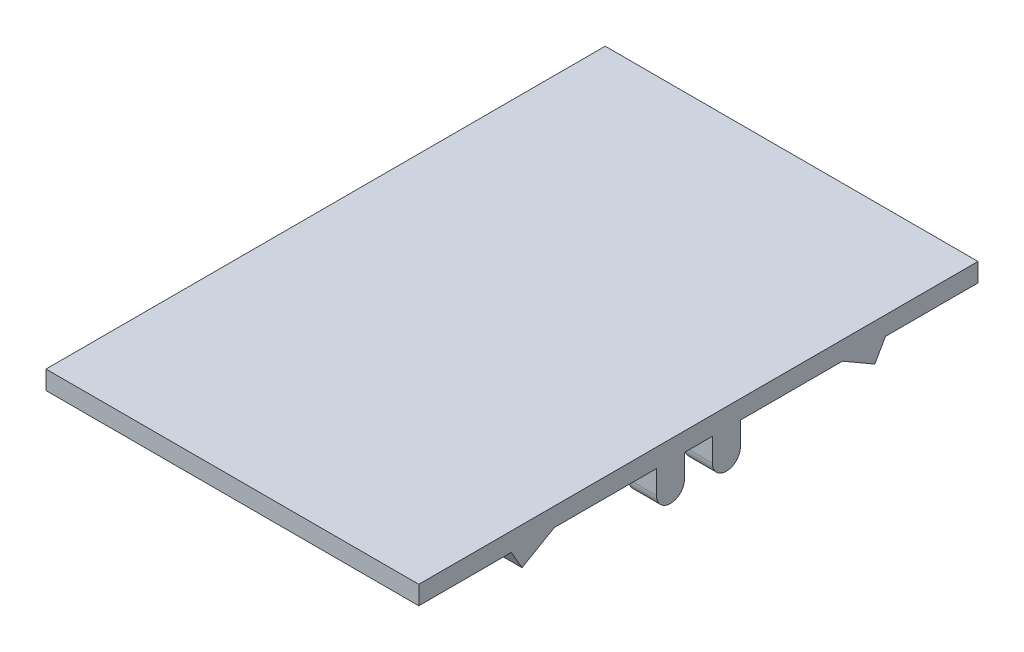
ISO-10303-21;
HEADER;
FILE_DESCRIPTION(('STEP AP214'),'2;1');
FILE_NAME('part.step','',(''),(''),'','','');
FILE_SCHEMA(('AUTOMOTIVE_DESIGN { 1 0 10303 214 1 1 1 1 }'));
ENDSEC;
DATA;
#1=APPLICATION_CONTEXT('core data for automotive mechanical design processes');
#2=APPLICATION_PROTOCOL_DEFINITION('international standard','automotive_design',2000,#1);
#3=PRODUCT_CONTEXT('',#1,'mechanical');
#4=PRODUCT('Part','Part','',(#3));
#5=PRODUCT_RELATED_PRODUCT_CATEGORY('part','',(#4));
#6=PRODUCT_DEFINITION_FORMATION('','',#4);
#7=PRODUCT_DEFINITION_CONTEXT('part definition',#1,'design');
#8=PRODUCT_DEFINITION('design','',#6,#7);
#9=PRODUCT_DEFINITION_SHAPE('','',#8);
#10=(LENGTH_UNIT() NAMED_UNIT(*) SI_UNIT(.MILLI.,.METRE.));
#11=(NAMED_UNIT(*) PLANE_ANGLE_UNIT() SI_UNIT($,.RADIAN.));
#12=(NAMED_UNIT(*) SI_UNIT($,.STERADIAN.) SOLID_ANGLE_UNIT());
#13=UNCERTAINTY_MEASURE_WITH_UNIT(LENGTH_MEASURE(1.E-05),#10,'distance_accuracy_value','');
#14=(GEOMETRIC_REPRESENTATION_CONTEXT(3) GLOBAL_UNCERTAINTY_ASSIGNED_CONTEXT((#13)) GLOBAL_UNIT_ASSIGNED_CONTEXT((#10,
#11,#12)) REPRESENTATION_CONTEXT('',''));
#15=CARTESIAN_POINT('',(0.,0.,0.));
#16=DIRECTION('',(0.,0.,1.));
#17=DIRECTION('',(1.,0.,0.));
#18=AXIS2_PLACEMENT_3D('',#15,#16,#17);
#19=CARTESIAN_POINT('',(0.,0.,0.));
#20=DIRECTION('',(0.,-1.,0.));
#21=DIRECTION('',(0.,0.,-1.));
#22=AXIS2_PLACEMENT_3D('',#19,#20,#21);
#23=PLANE('',#22);
#24=DIRECTION('',(-1.,0.,0.));
#25=VECTOR('',#24,1.);
#26=CARTESIAN_POINT('',(-170.,0.,-154.598033597152));
#27=LINE('',#26,#25);
#28=CARTESIAN_POINT('',(-170.,0.,-154.598033597152));
#29=VERTEX_POINT('',#28);
#30=CARTESIAN_POINT('',(-200.,0.,-154.598033597152));
#31=VERTEX_POINT('',#30);
#32=EDGE_CURVE('E263',#29,#31,#27,.T.);
#33=ORIENTED_EDGE('',*,*,#32,.F.);
#34=DIRECTION('',(0.,0.,-1.));
#35=VECTOR('',#34,1.);
#36=CARTESIAN_POINT('',(-170.,0.,-200.786055132322));
#37=LINE('',#36,#35);
#38=CARTESIAN_POINT('',(-170.,0.,-200.786055132322));
#39=VERTEX_POINT('',#38);
#40=EDGE_CURVE('E258',#29,#39,#37,.T.);
#41=ORIENTED_EDGE('',*,*,#40,.T.);
#42=DIRECTION('',(-1.,0.,0.));
#43=VECTOR('',#42,1.);
#44=CARTESIAN_POINT('',(-170.,0.,-200.786055132322));
#45=LINE('',#44,#43);
#46=CARTESIAN_POINT('',(-200.,0.,-200.786055132322));
#47=VERTEX_POINT('',#46);
#48=EDGE_CURVE('E243',#39,#47,#45,.T.);
#49=ORIENTED_EDGE('',*,*,#48,.T.);
#50=DIRECTION('',(0.,0.,1.));
#51=VECTOR('',#50,1.);
#52=CARTESIAN_POINT('',(-200.,0.,300.));
#53=LINE('',#52,#51);
#54=CARTESIAN_POINT('',(-200.,0.,-300.));
#55=VERTEX_POINT('',#54);
#56=EDGE_CURVE('E467',#55,#47,#53,.T.);
#57=ORIENTED_EDGE('',*,*,#56,.F.);
#58=DIRECTION('',(-1.,0.,0.));
#59=VECTOR('',#58,1.);
#60=CARTESIAN_POINT('',(-200.,0.,-300.));
#61=LINE('',#60,#59);
#62=CARTESIAN_POINT('',(200.,0.,-300.));
#63=VERTEX_POINT('',#62);
#64=EDGE_CURVE('E462',#63,#55,#61,.T.);
#65=ORIENTED_EDGE('',*,*,#64,.F.);
#66=DIRECTION('',(0.,0.,-1.));
#67=VECTOR('',#66,1.);
#68=CARTESIAN_POINT('',(200.,0.,300.));
#69=LINE('',#68,#67);
#70=CARTESIAN_POINT('',(200.,0.,-200.786055132322));
#71=VERTEX_POINT('',#70);
#72=EDGE_CURVE('E441',#71,#63,#69,.T.);
#73=ORIENTED_EDGE('',*,*,#72,.F.);
#74=DIRECTION('',(1.,0.,0.));
#75=VECTOR('',#74,1.);
#76=CARTESIAN_POINT('',(170.,0.,-200.786055132322));
#77=LINE('',#76,#75);
#78=CARTESIAN_POINT('',(170.,0.,-200.786055132322));
#79=VERTEX_POINT('',#78);
#80=EDGE_CURVE('E56',#79,#71,#77,.T.);
#81=ORIENTED_EDGE('',*,*,#80,.F.);
#82=DIRECTION('',(0.,0.,-1.));
#83=VECTOR('',#82,1.);
#84=CARTESIAN_POINT('',(170.,0.,-200.786055132322));
#85=LINE('',#84,#83);
#86=CARTESIAN_POINT('',(170.,0.,-154.598033597152));
#87=VERTEX_POINT('',#86);
#88=EDGE_CURVE('E272',#87,#79,#85,.T.);
#89=ORIENTED_EDGE('',*,*,#88,.F.);
#90=DIRECTION('',(1.,0.,0.));
#91=VECTOR('',#90,1.);
#92=CARTESIAN_POINT('',(170.,0.,-154.598033597152));
#93=LINE('',#92,#91);
#94=CARTESIAN_POINT('',(200.,0.,-154.598033597152));
#95=VERTEX_POINT('',#94);
#96=EDGE_CURVE('E280',#87,#95,#93,.T.);
#97=ORIENTED_EDGE('',*,*,#96,.T.);
#98=CARTESIAN_POINT('',(200.,0.,-45.));
#99=VERTEX_POINT('',#98);
#100=EDGE_CURVE('E489',#99,#95,#69,.T.);
#101=ORIENTED_EDGE('',*,*,#100,.F.);
#102=DIRECTION('',(1.,0.,0.));
#103=VECTOR('',#102,1.);
#104=CARTESIAN_POINT('',(170.,0.,-45.));
#105=LINE('',#104,#103);
#106=CARTESIAN_POINT('',(170.,0.,-45.));
#107=VERTEX_POINT('',#106);
#108=EDGE_CURVE('E413',#107,#99,#105,.T.);
#109=ORIENTED_EDGE('',*,*,#108,.F.);
#110=DIRECTION('',(0.,0.,-1.));
#111=VECTOR('',#110,1.);
#112=CARTESIAN_POINT('',(170.,0.,-45.));
#113=LINE('',#112,#111);
#114=CARTESIAN_POINT('',(170.,0.,-15.));
#115=VERTEX_POINT('',#114);
#116=EDGE_CURVE('E396',#115,#107,#113,.T.);
#117=ORIENTED_EDGE('',*,*,#116,.F.);
#118=DIRECTION('',(1.,0.,0.));
#119=VECTOR('',#118,1.);
#120=CARTESIAN_POINT('',(170.,0.,-15.));
#121=LINE('',#120,#119);
#122=CARTESIAN_POINT('',(200.,0.,-15.));
#123=VERTEX_POINT('',#122);
#124=EDGE_CURVE('E410',#115,#123,#121,.T.);
#125=ORIENTED_EDGE('',*,*,#124,.T.);
#126=CARTESIAN_POINT('',(200.,0.,15.));
#127=VERTEX_POINT('',#126);
#128=EDGE_CURVE('E464',#127,#123,#69,.T.);
#129=ORIENTED_EDGE('',*,*,#128,.F.);
#130=DIRECTION('',(1.,0.,0.));
#131=VECTOR('',#130,1.);
#132=CARTESIAN_POINT('',(170.,0.,15.));
#133=LINE('',#132,#131);
#134=CARTESIAN_POINT('',(170.,0.,15.));
#135=VERTEX_POINT('',#134);
#136=EDGE_CURVE('E445',#135,#127,#133,.T.);
#137=ORIENTED_EDGE('',*,*,#136,.F.);
#138=DIRECTION('',(0.,0.,1.));
#139=VECTOR('',#138,1.);
#140=CARTESIAN_POINT('',(170.,0.,45.));
#141=LINE('',#140,#139);
#142=CARTESIAN_POINT('',(170.,0.,45.));
#143=VERTEX_POINT('',#142);
#144=EDGE_CURVE('E425',#135,#143,#141,.T.);
#145=ORIENTED_EDGE('',*,*,#144,.T.);
#146=DIRECTION('',(1.,0.,0.));
#147=VECTOR('',#146,1.);
#148=CARTESIAN_POINT('',(170.,0.,45.));
#149=LINE('',#148,#147);
#150=CARTESIAN_POINT('',(200.,0.,45.));
#151=VERTEX_POINT('',#150);
#152=EDGE_CURVE('E442',#143,#151,#149,.T.);
#153=ORIENTED_EDGE('',*,*,#152,.T.);
#154=CARTESIAN_POINT('',(200.,0.,154.598033597152));
#155=VERTEX_POINT('',#154);
#156=EDGE_CURVE('E463',#155,#151,#69,.T.);
#157=ORIENTED_EDGE('',*,*,#156,.F.);
#158=DIRECTION('',(1.,0.,0.));
#159=VECTOR('',#158,1.);
#160=CARTESIAN_POINT('',(170.,0.,154.598033597152));
#161=LINE('',#160,#159);
#162=CARTESIAN_POINT('',(170.,0.,154.598033597152));
#163=VERTEX_POINT('',#162);
#164=EDGE_CURVE('E323',#163,#155,#161,.T.);
#165=ORIENTED_EDGE('',*,*,#164,.F.);
#166=DIRECTION('',(0.,0.,1.));
#167=VECTOR('',#166,1.);
#168=CARTESIAN_POINT('',(170.,0.,200.786055132322));
#169=LINE('',#168,#167);
#170=CARTESIAN_POINT('',(170.,0.,200.786055132322));
#171=VERTEX_POINT('',#170);
#172=EDGE_CURVE('E309',#163,#171,#169,.T.);
#173=ORIENTED_EDGE('',*,*,#172,.T.);
#174=DIRECTION('',(1.,0.,0.));
#175=VECTOR('',#174,1.);
#176=CARTESIAN_POINT('',(170.,0.,200.786055132322));
#177=LINE('',#176,#175);
#178=CARTESIAN_POINT('',(200.,0.,200.786055132322));
#179=VERTEX_POINT('',#178);
#180=EDGE_CURVE('E319',#171,#179,#177,.T.);
#181=ORIENTED_EDGE('',*,*,#180,.T.);
#182=CARTESIAN_POINT('',(200.,0.,300.));
#183=VERTEX_POINT('',#182);
#184=EDGE_CURVE('E459',#183,#179,#69,.T.);
#185=ORIENTED_EDGE('',*,*,#184,.F.);
#186=DIRECTION('',(1.,0.,0.));
#187=VECTOR('',#186,1.);
#188=CARTESIAN_POINT('',(-200.,0.,300.));
#189=LINE('',#188,#187);
#190=CARTESIAN_POINT('',(-200.,0.,300.));
#191=VERTEX_POINT('',#190);
#192=EDGE_CURVE('E452',#191,#183,#189,.T.);
#193=ORIENTED_EDGE('',*,*,#192,.F.);
#194=CARTESIAN_POINT('',(-200.,0.,200.786055132322));
#195=VERTEX_POINT('',#194);
#196=EDGE_CURVE('E466',#195,#191,#53,.T.);
#197=ORIENTED_EDGE('',*,*,#196,.F.);
#198=DIRECTION('',(-1.,0.,0.));
#199=VECTOR('',#198,1.);
#200=CARTESIAN_POINT('',(-170.,0.,200.786055132322));
#201=LINE('',#200,#199);
#202=CARTESIAN_POINT('',(-170.,0.,200.786055132322));
#203=VERTEX_POINT('',#202);
#204=EDGE_CURVE('E301',#203,#195,#201,.T.);
#205=ORIENTED_EDGE('',*,*,#204,.F.);
#206=DIRECTION('',(0.,0.,1.));
#207=VECTOR('',#206,1.);
#208=CARTESIAN_POINT('',(-170.,0.,200.786055132322));
#209=LINE('',#208,#207);
#210=CARTESIAN_POINT('',(-170.,0.,154.598033597152));
#211=VERTEX_POINT('',#210);
#212=EDGE_CURVE('E290',#211,#203,#209,.T.);
#213=ORIENTED_EDGE('',*,*,#212,.F.);
#214=DIRECTION('',(-1.,0.,0.));
#215=VECTOR('',#214,1.);
#216=CARTESIAN_POINT('',(-170.,0.,154.598033597152));
#217=LINE('',#216,#215);
#218=CARTESIAN_POINT('',(-200.,0.,154.598033597152));
#219=VERTEX_POINT('',#218);
#220=EDGE_CURVE('E298',#211,#219,#217,.T.);
#221=ORIENTED_EDGE('',*,*,#220,.T.);
#222=CARTESIAN_POINT('',(-200.,0.,45.));
#223=VERTEX_POINT('',#222);
#224=EDGE_CURVE('E470',#223,#219,#53,.T.);
#225=ORIENTED_EDGE('',*,*,#224,.F.);
#226=DIRECTION('',(-1.,0.,0.));
#227=VECTOR('',#226,1.);
#228=CARTESIAN_POINT('',(-170.,0.,45.));
#229=LINE('',#228,#227);
#230=CARTESIAN_POINT('',(-170.,0.,45.));
#231=VERTEX_POINT('',#230);
#232=EDGE_CURVE('E385',#231,#223,#229,.T.);
#233=ORIENTED_EDGE('',*,*,#232,.F.);
#234=DIRECTION('',(0.,0.,1.));
#235=VECTOR('',#234,1.);
#236=CARTESIAN_POINT('',(-170.,0.,45.));
#237=LINE('',#236,#235);
#238=CARTESIAN_POINT('',(-170.,0.,15.));
#239=VERTEX_POINT('',#238);
#240=EDGE_CURVE('E367',#239,#231,#237,.T.);
#241=ORIENTED_EDGE('',*,*,#240,.F.);
#242=DIRECTION('',(-1.,0.,0.));
#243=VECTOR('',#242,1.);
#244=CARTESIAN_POINT('',(-170.,0.,15.));
#245=LINE('',#244,#243);
#246=CARTESIAN_POINT('',(-200.,0.,15.));
#247=VERTEX_POINT('',#246);
#248=EDGE_CURVE('E382',#239,#247,#245,.T.);
#249=ORIENTED_EDGE('',*,*,#248,.T.);
#250=CARTESIAN_POINT('',(-200.,0.,-15.));
#251=VERTEX_POINT('',#250);
#252=EDGE_CURVE('E872',#251,#247,#53,.T.);
#253=ORIENTED_EDGE('',*,*,#252,.F.);
#254=DIRECTION('',(-1.,0.,0.));
#255=VECTOR('',#254,1.);
#256=CARTESIAN_POINT('',(-170.,0.,-15.));
#257=LINE('',#256,#255);
#258=CARTESIAN_POINT('',(-170.,0.,-15.));
#259=VERTEX_POINT('',#258);
#260=EDGE_CURVE('E357',#259,#251,#257,.T.);
#261=ORIENTED_EDGE('',*,*,#260,.F.);
#262=DIRECTION('',(0.,0.,-1.));
#263=VECTOR('',#262,1.);
#264=CARTESIAN_POINT('',(-170.,0.,-45.));
#265=LINE('',#264,#263);
#266=CARTESIAN_POINT('',(-170.,0.,-45.));
#267=VERTEX_POINT('',#266);
#268=EDGE_CURVE('E338',#259,#267,#265,.T.);
#269=ORIENTED_EDGE('',*,*,#268,.T.);
#270=DIRECTION('',(-1.,0.,0.));
#271=VECTOR('',#270,1.);
#272=CARTESIAN_POINT('',(-170.,0.,-45.));
#273=LINE('',#272,#271);
#274=CARTESIAN_POINT('',(-200.,0.,-45.));
#275=VERTEX_POINT('',#274);
#276=EDGE_CURVE('E354',#267,#275,#273,.T.);
#277=ORIENTED_EDGE('',*,*,#276,.T.);
#278=EDGE_CURVE('E469',#31,#275,#53,.T.);
#279=ORIENTED_EDGE('',*,*,#278,.F.);
#280=EDGE_LOOP('',(#33,#41,#49,#57,#65,#73,#81,#89,#97,#101,#109,#117,#125,#129,#137,#145,#153,
#157,#165,#173,#181,#185,#193,#197,#205,#213,#221,#225,#233,#241,#249,#253,#261,#269,#277,#279));
#281=FACE_BOUND('',#280,.T.);
#282=ADVANCED_FACE('F33',(#281),#23,.T.);
#283=CARTESIAN_POINT('',(200.,20.,300.));
#284=DIRECTION('',(-1.,0.,0.));
#285=DIRECTION('',(0.,0.,1.));
#286=AXIS2_PLACEMENT_3D('',#283,#284,#285);
#287=PLANE('',#286);
#288=ORIENTED_EDGE('',*,*,#184,.T.);
#289=DIRECTION('',(0.,-0.86602540378444,-0.499999999999998));
#290=VECTOR('',#289,1.);
#291=CARTESIAN_POINT('',(200.,-19.9999999999999,189.23904974853));
#292=LINE('',#291,#290);
#293=CARTESIAN_POINT('',(200.,-19.9999999999999,189.23904974853));
#294=VERTEX_POINT('',#293);
#295=EDGE_CURVE('E303',#179,#294,#292,.T.);
#296=ORIENTED_EDGE('',*,*,#295,.T.);
#297=DIRECTION('',(0.,0.499999999999998,-0.86602540378444));
#298=VECTOR('',#297,1.);
#299=CARTESIAN_POINT('',(200.,0.,154.598033597152));
#300=LINE('',#299,#298);
#301=EDGE_CURVE('E313',#294,#155,#300,.T.);
#302=ORIENTED_EDGE('',*,*,#301,.T.);
#303=ORIENTED_EDGE('',*,*,#156,.T.);
#304=DIRECTION('',(0.,-1.,0.));
#305=VECTOR('',#304,1.);
#306=CARTESIAN_POINT('',(200.,-25.,45.));
#307=LINE('',#306,#305);
#308=CARTESIAN_POINT('',(200.,-25.,45.));
#309=VERTEX_POINT('',#308);
#310=EDGE_CURVE('E422',#151,#309,#307,.T.);
#311=ORIENTED_EDGE('',*,*,#310,.T.);
#312=CARTESIAN_POINT('',(200.,-25.,30.));
#313=DIRECTION('',(1.,0.,0.));
#314=DIRECTION('',(0.,0.,-1.));
#315=AXIS2_PLACEMENT_3D('',#312,#313,#314);
#316=CIRCLE('',#315,15.);
#317=CARTESIAN_POINT('',(200.,-25.,15.));
#318=VERTEX_POINT('',#317);
#319=EDGE_CURVE('E409',#309,#318,#316,.T.);
#320=ORIENTED_EDGE('',*,*,#319,.T.);
#321=DIRECTION('',(0.,1.,0.));
#322=VECTOR('',#321,1.);
#323=CARTESIAN_POINT('',(200.,0.,15.));
#324=LINE('',#323,#322);
#325=EDGE_CURVE('E434',#318,#127,#324,.T.);
#326=ORIENTED_EDGE('',*,*,#325,.T.);
#327=ORIENTED_EDGE('',*,*,#128,.T.);
#328=DIRECTION('',(0.,1.,0.));
#329=VECTOR('',#328,1.);
#330=CARTESIAN_POINT('',(200.,0.,-15.));
#331=LINE('',#330,#329);
#332=CARTESIAN_POINT('',(200.,-25.,-15.));
#333=VERTEX_POINT('',#332);
#334=EDGE_CURVE('E394',#333,#123,#331,.T.);
#335=ORIENTED_EDGE('',*,*,#334,.F.);
#336=CARTESIAN_POINT('',(200.,-25.,-30.));
#337=DIRECTION('',(-1.,0.,0.));
#338=DIRECTION('',(0.,0.,1.));
#339=AXIS2_PLACEMENT_3D('',#336,#337,#338);
#340=CIRCLE('',#339,15.);
#341=CARTESIAN_POINT('',(200.,-25.,-45.));
#342=VERTEX_POINT('',#341);
#343=EDGE_CURVE('E381',#342,#333,#340,.T.);
#344=ORIENTED_EDGE('',*,*,#343,.F.);
#345=DIRECTION('',(0.,-1.,0.));
#346=VECTOR('',#345,1.);
#347=CARTESIAN_POINT('',(200.,-25.,-45.));
#348=LINE('',#347,#346);
#349=EDGE_CURVE('E403',#99,#342,#348,.T.);
#350=ORIENTED_EDGE('',*,*,#349,.F.);
#351=ORIENTED_EDGE('',*,*,#100,.T.);
#352=DIRECTION('',(0.,0.499999999999998,0.86602540378444));
#353=VECTOR('',#352,1.);
#354=CARTESIAN_POINT('',(200.,0.,-154.598033597152));
#355=LINE('',#354,#353);
#356=CARTESIAN_POINT('',(200.,-19.9999999999999,-189.23904974853));
#357=VERTEX_POINT('',#356);
#358=EDGE_CURVE('E270',#357,#95,#355,.T.);
#359=ORIENTED_EDGE('',*,*,#358,.F.);
#360=DIRECTION('',(0.,-0.86602540378444,0.499999999999998));
#361=VECTOR('',#360,1.);
#362=CARTESIAN_POINT('',(200.,-19.9999999999999,-189.23904974853));
#363=LINE('',#362,#361);
#364=EDGE_CURVE('E276',#71,#357,#363,.T.);
#365=ORIENTED_EDGE('',*,*,#364,.F.);
#366=ORIENTED_EDGE('',*,*,#72,.T.);
#367=DIRECTION('',(0.,-1.,0.));
#368=VECTOR('',#367,1.);
#369=CARTESIAN_POINT('',(200.,20.,-300.));
#370=LINE('',#369,#368);
#371=CARTESIAN_POINT('',(200.,20.,-300.));
#372=VERTEX_POINT('',#371);
#373=EDGE_CURVE('E11',#372,#63,#370,.T.);
#374=ORIENTED_EDGE('',*,*,#373,.F.);
#375=DIRECTION('',(0.,0.,-1.));
#376=VECTOR('',#375,1.);
#377=CARTESIAN_POINT('',(200.,20.,300.));
#378=LINE('',#377,#376);
#379=CARTESIAN_POINT('',(200.,20.,300.));
#380=VERTEX_POINT('',#379);
#381=EDGE_CURVE('E448',#380,#372,#378,.T.);
#382=ORIENTED_EDGE('',*,*,#381,.F.);
#383=DIRECTION('',(0.,-1.,0.));
#384=VECTOR('',#383,1.);
#385=CARTESIAN_POINT('',(200.,20.,300.));
#386=LINE('',#385,#384);
#387=EDGE_CURVE('E458',#380,#183,#386,.T.);
#388=ORIENTED_EDGE('',*,*,#387,.T.);
#389=EDGE_LOOP('',(#288,#296,#302,#303,#311,#320,#326,#327,#335,#344,#350,#351,#359,#365,#366,
#374,#382,#388));
#390=FACE_BOUND('',#389,.T.);
#391=ADVANCED_FACE('F35',(#390),#287,.F.);
#392=CARTESIAN_POINT('',(-200.,20.,-300.));
#393=DIRECTION('',(0.,0.,1.));
#394=DIRECTION('',(1.,0.,0.));
#395=AXIS2_PLACEMENT_3D('',#392,#393,#394);
#396=PLANE('',#395);
#397=ORIENTED_EDGE('',*,*,#64,.T.);
#398=DIRECTION('',(0.,-1.,0.));
#399=VECTOR('',#398,1.);
#400=CARTESIAN_POINT('',(-200.,20.,-300.));
#401=LINE('',#400,#399);
#402=CARTESIAN_POINT('',(-200.,20.,-300.));
#403=VERTEX_POINT('',#402);
#404=EDGE_CURVE('E41',#403,#55,#401,.T.);
#405=ORIENTED_EDGE('',*,*,#404,.F.);
#406=DIRECTION('',(-1.,0.,0.));
#407=VECTOR('',#406,1.);
#408=CARTESIAN_POINT('',(-200.,20.,-300.));
#409=LINE('',#408,#407);
#410=EDGE_CURVE('E451',#372,#403,#409,.T.);
#411=ORIENTED_EDGE('',*,*,#410,.F.);
#412=ORIENTED_EDGE('',*,*,#373,.T.);
#413=EDGE_LOOP('',(#397,#405,#411,#412));
#414=FACE_BOUND('',#413,.T.);
#415=ADVANCED_FACE('F485',(#414),#396,.F.);
#416=CARTESIAN_POINT('',(-200.,20.,300.));
#417=DIRECTION('',(1.,0.,0.));
#418=DIRECTION('',(0.,0.,-1.));
#419=AXIS2_PLACEMENT_3D('',#416,#417,#418);
#420=PLANE('',#419);
#421=ORIENTED_EDGE('',*,*,#56,.T.);
#422=DIRECTION('',(0.,-0.86602540378444,0.499999999999998));
#423=VECTOR('',#422,1.);
#424=CARTESIAN_POINT('',(-200.,-19.9999999999999,-189.23904974853));
#425=LINE('',#424,#423);
#426=CARTESIAN_POINT('',(-200.,-19.9999999999999,-189.23904974853));
#427=VERTEX_POINT('',#426);
#428=EDGE_CURVE('E248',#47,#427,#425,.T.);
#429=ORIENTED_EDGE('',*,*,#428,.T.);
#430=DIRECTION('',(0.,0.499999999999998,0.86602540378444));
#431=VECTOR('',#430,1.);
#432=CARTESIAN_POINT('',(-200.,0.,-154.598033597152));
#433=LINE('',#432,#431);
#434=EDGE_CURVE('E48',#427,#31,#433,.T.);
#435=ORIENTED_EDGE('',*,*,#434,.T.);
#436=ORIENTED_EDGE('',*,*,#278,.T.);
#437=DIRECTION('',(0.,-1.,0.));
#438=VECTOR('',#437,1.);
#439=CARTESIAN_POINT('',(-200.,-25.,-45.));
#440=LINE('',#439,#438);
#441=CARTESIAN_POINT('',(-200.,-25.,-45.));
#442=VERTEX_POINT('',#441);
#443=EDGE_CURVE('E335',#275,#442,#440,.T.);
#444=ORIENTED_EDGE('',*,*,#443,.T.);
#445=CARTESIAN_POINT('',(-200.,-25.,-30.));
#446=DIRECTION('',(-1.,0.,0.));
#447=DIRECTION('',(0.,0.,1.));
#448=AXIS2_PLACEMENT_3D('',#445,#446,#447);
#449=CIRCLE('',#448,15.);
#450=CARTESIAN_POINT('',(-200.,-25.,-15.));
#451=VERTEX_POINT('',#450);
#452=EDGE_CURVE('E326',#442,#451,#449,.T.);
#453=ORIENTED_EDGE('',*,*,#452,.T.);
#454=DIRECTION('',(0.,1.,0.));
#455=VECTOR('',#454,1.);
#456=CARTESIAN_POINT('',(-200.,0.,-15.));
#457=LINE('',#456,#455);
#458=EDGE_CURVE('E347',#451,#251,#457,.T.);
#459=ORIENTED_EDGE('',*,*,#458,.T.);
#460=ORIENTED_EDGE('',*,*,#252,.T.);
#461=DIRECTION('',(0.,1.,0.));
#462=VECTOR('',#461,1.);
#463=CARTESIAN_POINT('',(-200.,0.,15.));
#464=LINE('',#463,#462);
#465=CARTESIAN_POINT('',(-200.,-25.,15.));
#466=VERTEX_POINT('',#465);
#467=EDGE_CURVE('E365',#466,#247,#464,.T.);
#468=ORIENTED_EDGE('',*,*,#467,.F.);
#469=CARTESIAN_POINT('',(-200.,-25.,30.));
#470=DIRECTION('',(1.,0.,0.));
#471=DIRECTION('',(0.,0.,-1.));
#472=AXIS2_PLACEMENT_3D('',#469,#470,#471);
#473=CIRCLE('',#472,15.);
#474=CARTESIAN_POINT('',(-200.,-25.,45.));
#475=VERTEX_POINT('',#474);
#476=EDGE_CURVE('E353',#475,#466,#473,.T.);
#477=ORIENTED_EDGE('',*,*,#476,.F.);
#478=DIRECTION('',(0.,-1.,0.));
#479=VECTOR('',#478,1.);
#480=CARTESIAN_POINT('',(-200.,-25.,45.));
#481=LINE('',#480,#479);
#482=EDGE_CURVE('E374',#223,#475,#481,.T.);
#483=ORIENTED_EDGE('',*,*,#482,.F.);
#484=ORIENTED_EDGE('',*,*,#224,.T.);
#485=DIRECTION('',(0.,0.499999999999998,-0.86602540378444));
#486=VECTOR('',#485,1.);
#487=CARTESIAN_POINT('',(-200.,0.,154.598033597152));
#488=LINE('',#487,#486);
#489=CARTESIAN_POINT('',(-200.,-19.9999999999999,189.23904974853));
#490=VERTEX_POINT('',#489);
#491=EDGE_CURVE('E284',#490,#219,#488,.T.);
#492=ORIENTED_EDGE('',*,*,#491,.F.);
#493=DIRECTION('',(0.,-0.86602540378444,-0.499999999999998));
#494=VECTOR('',#493,1.);
#495=CARTESIAN_POINT('',(-200.,-19.9999999999999,189.23904974853));
#496=LINE('',#495,#494);
#497=EDGE_CURVE('E294',#195,#490,#496,.T.);
#498=ORIENTED_EDGE('',*,*,#497,.F.);
#499=ORIENTED_EDGE('',*,*,#196,.T.);
#500=DIRECTION('',(0.,-1.,0.));
#501=VECTOR('',#500,1.);
#502=CARTESIAN_POINT('',(-200.,20.,300.));
#503=LINE('',#502,#501);
#504=CARTESIAN_POINT('',(-200.,20.,300.));
#505=VERTEX_POINT('',#504);
#506=EDGE_CURVE('E474',#505,#191,#503,.T.);
#507=ORIENTED_EDGE('',*,*,#506,.F.);
#508=DIRECTION('',(0.,0.,1.));
#509=VECTOR('',#508,1.);
#510=CARTESIAN_POINT('',(-200.,20.,300.));
#511=LINE('',#510,#509);
#512=EDGE_CURVE('E454',#403,#505,#511,.T.);
#513=ORIENTED_EDGE('',*,*,#512,.F.);
#514=ORIENTED_EDGE('',*,*,#404,.T.);
#515=EDGE_LOOP('',(#421,#429,#435,#436,#444,#453,#459,#460,#468,#477,#483,#484,#492,#498,#499,
#507,#513,#514));
#516=FACE_BOUND('',#515,.T.);
#517=ADVANCED_FACE('F479',(#516),#420,.F.);
#518=CARTESIAN_POINT('',(-200.,20.,300.));
#519=DIRECTION('',(0.,0.,-1.));
#520=DIRECTION('',(-1.,0.,0.));
#521=AXIS2_PLACEMENT_3D('',#518,#519,#520);
#522=PLANE('',#521);
#523=ORIENTED_EDGE('',*,*,#192,.T.);
#524=ORIENTED_EDGE('',*,*,#387,.F.);
#525=DIRECTION('',(1.,0.,0.));
#526=VECTOR('',#525,1.);
#527=CARTESIAN_POINT('',(-200.,20.,300.));
#528=LINE('',#527,#526);
#529=EDGE_CURVE('E456',#505,#380,#528,.T.);
#530=ORIENTED_EDGE('',*,*,#529,.F.);
#531=ORIENTED_EDGE('',*,*,#506,.T.);
#532=EDGE_LOOP('',(#523,#524,#530,#531));
#533=FACE_BOUND('',#532,.T.);
#534=ADVANCED_FACE('F544',(#533),#522,.F.);
#535=CARTESIAN_POINT('',(0.,20.,0.));
#536=DIRECTION('',(0.,-1.,0.));
#537=DIRECTION('',(0.,0.,-1.));
#538=AXIS2_PLACEMENT_3D('',#535,#536,#537);
#539=PLANE('',#538);
#540=ORIENTED_EDGE('',*,*,#381,.T.);
#541=ORIENTED_EDGE('',*,*,#410,.T.);
#542=ORIENTED_EDGE('',*,*,#512,.T.);
#543=ORIENTED_EDGE('',*,*,#529,.T.);
#544=EDGE_LOOP('',(#540,#541,#542,#543));
#545=FACE_BOUND('',#544,.T.);
#546=ADVANCED_FACE('F542',(#545),#539,.F.);
#547=CARTESIAN_POINT('',(170.,-25.,30.));
#548=DIRECTION('',(1.,0.,0.));
#549=DIRECTION('',(0.,0.,-1.));
#550=AXIS2_PLACEMENT_3D('',#547,#548,#549);
#551=CYLINDRICAL_SURFACE('',#550,15.);
#552=ORIENTED_EDGE('',*,*,#319,.F.);
#553=DIRECTION('',(1.,0.,0.));
#554=VECTOR('',#553,1.);
#555=CARTESIAN_POINT('',(170.,-25.,45.));
#556=LINE('',#555,#554);
#557=CARTESIAN_POINT('',(170.,-25.,45.));
#558=VERTEX_POINT('',#557);
#559=EDGE_CURVE('E439',#558,#309,#556,.T.);
#560=ORIENTED_EDGE('',*,*,#559,.F.);
#561=CARTESIAN_POINT('',(170.,-25.,30.));
#562=DIRECTION('',(1.,0.,0.));
#563=DIRECTION('',(0.,0.,-1.));
#564=AXIS2_PLACEMENT_3D('',#561,#562,#563);
#565=CIRCLE('',#564,15.);
#566=CARTESIAN_POINT('',(170.,-25.,15.));
#567=VERTEX_POINT('',#566);
#568=EDGE_CURVE('E418',#558,#567,#565,.T.);
#569=ORIENTED_EDGE('',*,*,#568,.T.);
#570=DIRECTION('',(1.,0.,0.));
#571=VECTOR('',#570,1.);
#572=CARTESIAN_POINT('',(170.,-25.,15.));
#573=LINE('',#572,#571);
#574=EDGE_CURVE('E431',#567,#318,#573,.T.);
#575=ORIENTED_EDGE('',*,*,#574,.T.);
#576=EDGE_LOOP('',(#552,#560,#569,#575));
#577=FACE_BOUND('',#576,.T.);
#578=ADVANCED_FACE('F562',(#577),#551,.T.);
#579=CARTESIAN_POINT('',(170.,-25.,45.));
#580=DIRECTION('',(0.,0.,1.));
#581=DIRECTION('',(0.,-1.,0.));
#582=AXIS2_PLACEMENT_3D('',#579,#580,#581);
#583=PLANE('',#582);
#584=ORIENTED_EDGE('',*,*,#310,.F.);
#585=ORIENTED_EDGE('',*,*,#152,.F.);
#586=DIRECTION('',(0.,-1.,0.));
#587=VECTOR('',#586,1.);
#588=CARTESIAN_POINT('',(170.,-25.,45.));
#589=LINE('',#588,#587);
#590=EDGE_CURVE('E428',#143,#558,#589,.T.);
#591=ORIENTED_EDGE('',*,*,#590,.T.);
#592=ORIENTED_EDGE('',*,*,#559,.T.);
#593=EDGE_LOOP('',(#584,#585,#591,#592));
#594=FACE_BOUND('',#593,.T.);
#595=ADVANCED_FACE('F569',(#594),#583,.T.);
#596=CARTESIAN_POINT('',(170.,0.,15.));
#597=DIRECTION('',(0.,0.,-1.));
#598=DIRECTION('',(0.,1.,0.));
#599=AXIS2_PLACEMENT_3D('',#596,#597,#598);
#600=PLANE('',#599);
#601=ORIENTED_EDGE('',*,*,#325,.F.);
#602=ORIENTED_EDGE('',*,*,#574,.F.);
#603=DIRECTION('',(0.,1.,0.));
#604=VECTOR('',#603,1.);
#605=CARTESIAN_POINT('',(170.,0.,15.));
#606=LINE('',#605,#604);
#607=EDGE_CURVE('E421',#567,#135,#606,.T.);
#608=ORIENTED_EDGE('',*,*,#607,.T.);
#609=ORIENTED_EDGE('',*,*,#136,.T.);
#610=EDGE_LOOP('',(#601,#602,#608,#609));
#611=FACE_BOUND('',#610,.T.);
#612=ADVANCED_FACE('F576',(#611),#600,.T.);
#613=CARTESIAN_POINT('',(170.,-25.,30.));
#614=DIRECTION('',(1.,0.,0.));
#615=DIRECTION('',(0.,0.,-1.));
#616=AXIS2_PLACEMENT_3D('',#613,#614,#615);
#617=PLANE('',#616);
#618=ORIENTED_EDGE('',*,*,#568,.F.);
#619=ORIENTED_EDGE('',*,*,#590,.F.);
#620=ORIENTED_EDGE('',*,*,#144,.F.);
#621=ORIENTED_EDGE('',*,*,#607,.F.);
#622=EDGE_LOOP('',(#618,#619,#620,#621));
#623=FACE_BOUND('',#622,.T.);
#624=ADVANCED_FACE('F584',(#623),#617,.F.);
#625=CARTESIAN_POINT('',(170.,-25.,-30.));
#626=DIRECTION('',(1.,0.,0.));
#627=DIRECTION('',(0.,0.,-1.));
#628=AXIS2_PLACEMENT_3D('',#625,#626,#627);
#629=CYLINDRICAL_SURFACE('',#628,15.);
#630=ORIENTED_EDGE('',*,*,#343,.T.);
#631=DIRECTION('',(1.,0.,0.));
#632=VECTOR('',#631,1.);
#633=CARTESIAN_POINT('',(170.,-25.,-15.));
#634=LINE('',#633,#632);
#635=CARTESIAN_POINT('',(170.,-25.,-15.));
#636=VERTEX_POINT('',#635);
#637=EDGE_CURVE('E406',#636,#333,#634,.T.);
#638=ORIENTED_EDGE('',*,*,#637,.F.);
#639=CARTESIAN_POINT('',(170.,-25.,-30.));
#640=DIRECTION('',(-1.,0.,0.));
#641=DIRECTION('',(0.,0.,1.));
#642=AXIS2_PLACEMENT_3D('',#639,#640,#641);
#643=CIRCLE('',#642,15.);
#644=CARTESIAN_POINT('',(170.,-25.,-45.));
#645=VERTEX_POINT('',#644);
#646=EDGE_CURVE('E390',#645,#636,#643,.T.);
#647=ORIENTED_EDGE('',*,*,#646,.F.);
#648=DIRECTION('',(1.,0.,0.));
#649=VECTOR('',#648,1.);
#650=CARTESIAN_POINT('',(170.,-25.,-45.));
#651=LINE('',#650,#649);
#652=EDGE_CURVE('E400',#645,#342,#651,.T.);
#653=ORIENTED_EDGE('',*,*,#652,.T.);
#654=EDGE_LOOP('',(#630,#638,#647,#653));
#655=FACE_BOUND('',#654,.T.);
#656=ADVANCED_FACE('F506',(#655),#629,.T.);
#657=CARTESIAN_POINT('',(170.,0.,-15.));
#658=DIRECTION('',(0.,0.,-1.));
#659=DIRECTION('',(0.,1.,0.));
#660=AXIS2_PLACEMENT_3D('',#657,#658,#659);
#661=PLANE('',#660);
#662=ORIENTED_EDGE('',*,*,#334,.T.);
#663=ORIENTED_EDGE('',*,*,#124,.F.);
#664=DIRECTION('',(0.,1.,0.));
#665=VECTOR('',#664,1.);
#666=CARTESIAN_POINT('',(170.,0.,-15.));
#667=LINE('',#666,#665);
#668=EDGE_CURVE('E398',#636,#115,#667,.T.);
#669=ORIENTED_EDGE('',*,*,#668,.F.);
#670=ORIENTED_EDGE('',*,*,#637,.T.);
#671=EDGE_LOOP('',(#662,#663,#669,#670));
#672=FACE_BOUND('',#671,.T.);
#673=ADVANCED_FACE('F502',(#672),#661,.F.);
#674=CARTESIAN_POINT('',(170.,-25.,-45.));
#675=DIRECTION('',(0.,0.,1.));
#676=DIRECTION('',(0.,-1.,0.));
#677=AXIS2_PLACEMENT_3D('',#674,#675,#676);
#678=PLANE('',#677);
#679=ORIENTED_EDGE('',*,*,#349,.T.);
#680=ORIENTED_EDGE('',*,*,#652,.F.);
#681=DIRECTION('',(0.,-1.,0.));
#682=VECTOR('',#681,1.);
#683=CARTESIAN_POINT('',(170.,-25.,-45.));
#684=LINE('',#683,#682);
#685=EDGE_CURVE('E393',#107,#645,#684,.T.);
#686=ORIENTED_EDGE('',*,*,#685,.F.);
#687=ORIENTED_EDGE('',*,*,#108,.T.);
#688=EDGE_LOOP('',(#679,#680,#686,#687));
#689=FACE_BOUND('',#688,.T.);
#690=ADVANCED_FACE('F511',(#689),#678,.F.);
#691=CARTESIAN_POINT('',(170.,-25.,-30.));
#692=DIRECTION('',(1.,0.,0.));
#693=DIRECTION('',(0.,0.,1.));
#694=AXIS2_PLACEMENT_3D('',#691,#692,#693);
#695=PLANE('',#694);
#696=ORIENTED_EDGE('',*,*,#646,.T.);
#697=ORIENTED_EDGE('',*,*,#668,.T.);
#698=ORIENTED_EDGE('',*,*,#116,.T.);
#699=ORIENTED_EDGE('',*,*,#685,.T.);
#700=EDGE_LOOP('',(#696,#697,#698,#699));
#701=FACE_BOUND('',#700,.T.);
#702=ADVANCED_FACE('F611',(#701),#695,.F.);
#703=CARTESIAN_POINT('',(-170.,-25.,30.));
#704=DIRECTION('',(-1.,0.,0.));
#705=DIRECTION('',(0.,0.,1.));
#706=AXIS2_PLACEMENT_3D('',#703,#704,#705);
#707=CYLINDRICAL_SURFACE('',#706,15.);
#708=ORIENTED_EDGE('',*,*,#476,.T.);
#709=DIRECTION('',(-1.,0.,0.));
#710=VECTOR('',#709,1.);
#711=CARTESIAN_POINT('',(-170.,-25.,15.));
#712=LINE('',#711,#710);
#713=CARTESIAN_POINT('',(-170.,-25.,15.));
#714=VERTEX_POINT('',#713);
#715=EDGE_CURVE('E378',#714,#466,#712,.T.);
#716=ORIENTED_EDGE('',*,*,#715,.F.);
#717=CARTESIAN_POINT('',(-170.,-25.,30.));
#718=DIRECTION('',(1.,0.,0.));
#719=DIRECTION('',(0.,0.,-1.));
#720=AXIS2_PLACEMENT_3D('',#717,#718,#719);
#721=CIRCLE('',#720,15.);
#722=CARTESIAN_POINT('',(-170.,-25.,45.));
#723=VERTEX_POINT('',#722);
#724=EDGE_CURVE('E361',#723,#714,#721,.T.);
#725=ORIENTED_EDGE('',*,*,#724,.F.);
#726=DIRECTION('',(-1.,0.,0.));
#727=VECTOR('',#726,1.);
#728=CARTESIAN_POINT('',(-170.,-25.,45.));
#729=LINE('',#728,#727);
#730=EDGE_CURVE('E371',#723,#475,#729,.T.);
#731=ORIENTED_EDGE('',*,*,#730,.T.);
#732=EDGE_LOOP('',(#708,#716,#725,#731));
#733=FACE_BOUND('',#732,.T.);
#734=ADVANCED_FACE('F618',(#733),#707,.T.);
#735=CARTESIAN_POINT('',(-170.,0.,15.));
#736=DIRECTION('',(0.,0.,1.));
#737=DIRECTION('',(0.,-1.,0.));
#738=AXIS2_PLACEMENT_3D('',#735,#736,#737);
#739=PLANE('',#738);
#740=ORIENTED_EDGE('',*,*,#467,.T.);
#741=ORIENTED_EDGE('',*,*,#248,.F.);
#742=DIRECTION('',(0.,1.,0.));
#743=VECTOR('',#742,1.);
#744=CARTESIAN_POINT('',(-170.,0.,15.));
#745=LINE('',#744,#743);
#746=EDGE_CURVE('E369',#714,#239,#745,.T.);
#747=ORIENTED_EDGE('',*,*,#746,.F.);
#748=ORIENTED_EDGE('',*,*,#715,.T.);
#749=EDGE_LOOP('',(#740,#741,#747,#748));
#750=FACE_BOUND('',#749,.T.);
#751=ADVANCED_FACE('F626',(#750),#739,.F.);
#752=CARTESIAN_POINT('',(-170.,-25.,45.));
#753=DIRECTION('',(0.,0.,-1.));
#754=DIRECTION('',(0.,1.,0.));
#755=AXIS2_PLACEMENT_3D('',#752,#753,#754);
#756=PLANE('',#755);
#757=ORIENTED_EDGE('',*,*,#482,.T.);
#758=ORIENTED_EDGE('',*,*,#730,.F.);
#759=DIRECTION('',(0.,-1.,0.));
#760=VECTOR('',#759,1.);
#761=CARTESIAN_POINT('',(-170.,-25.,45.));
#762=LINE('',#761,#760);
#763=EDGE_CURVE('E364',#231,#723,#762,.T.);
#764=ORIENTED_EDGE('',*,*,#763,.F.);
#765=ORIENTED_EDGE('',*,*,#232,.T.);
#766=EDGE_LOOP('',(#757,#758,#764,#765));
#767=FACE_BOUND('',#766,.T.);
#768=ADVANCED_FACE('F634',(#767),#756,.F.);
#769=CARTESIAN_POINT('',(-170.,-25.,30.));
#770=DIRECTION('',(-1.,0.,0.));
#771=DIRECTION('',(0.,0.,-1.));
#772=AXIS2_PLACEMENT_3D('',#769,#770,#771);
#773=PLANE('',#772);
#774=ORIENTED_EDGE('',*,*,#724,.T.);
#775=ORIENTED_EDGE('',*,*,#746,.T.);
#776=ORIENTED_EDGE('',*,*,#240,.T.);
#777=ORIENTED_EDGE('',*,*,#763,.T.);
#778=EDGE_LOOP('',(#774,#775,#776,#777));
#779=FACE_BOUND('',#778,.T.);
#780=ADVANCED_FACE('F642',(#779),#773,.F.);
#781=CARTESIAN_POINT('',(-170.,-25.,-30.));
#782=DIRECTION('',(-1.,0.,0.));
#783=DIRECTION('',(0.,0.,1.));
#784=AXIS2_PLACEMENT_3D('',#781,#782,#783);
#785=CYLINDRICAL_SURFACE('',#784,15.);
#786=ORIENTED_EDGE('',*,*,#452,.F.);
#787=DIRECTION('',(-1.,0.,0.));
#788=VECTOR('',#787,1.);
#789=CARTESIAN_POINT('',(-170.,-25.,-45.));
#790=LINE('',#789,#788);
#791=CARTESIAN_POINT('',(-170.,-25.,-45.));
#792=VERTEX_POINT('',#791);
#793=EDGE_CURVE('E351',#792,#442,#790,.T.);
#794=ORIENTED_EDGE('',*,*,#793,.F.);
#795=CARTESIAN_POINT('',(-170.,-25.,-30.));
#796=DIRECTION('',(-1.,0.,0.));
#797=DIRECTION('',(0.,0.,1.));
#798=AXIS2_PLACEMENT_3D('',#795,#796,#797);
#799=CIRCLE('',#798,15.);
#800=CARTESIAN_POINT('',(-170.,-25.,-15.));
#801=VERTEX_POINT('',#800);
#802=EDGE_CURVE('E331',#792,#801,#799,.T.);
#803=ORIENTED_EDGE('',*,*,#802,.T.);
#804=DIRECTION('',(-1.,0.,0.));
#805=VECTOR('',#804,1.);
#806=CARTESIAN_POINT('',(-170.,-25.,-15.));
#807=LINE('',#806,#805);
#808=EDGE_CURVE('E344',#801,#451,#807,.T.);
#809=ORIENTED_EDGE('',*,*,#808,.T.);
#810=EDGE_LOOP('',(#786,#794,#803,#809));
#811=FACE_BOUND('',#810,.T.);
#812=ADVANCED_FACE('F650',(#811),#785,.T.);
#813=CARTESIAN_POINT('',(-170.,-25.,-45.));
#814=DIRECTION('',(0.,0.,-1.));
#815=DIRECTION('',(0.,1.,0.));
#816=AXIS2_PLACEMENT_3D('',#813,#814,#815);
#817=PLANE('',#816);
#818=ORIENTED_EDGE('',*,*,#443,.F.);
#819=ORIENTED_EDGE('',*,*,#276,.F.);
#820=DIRECTION('',(0.,-1.,0.));
#821=VECTOR('',#820,1.);
#822=CARTESIAN_POINT('',(-170.,-25.,-45.));
#823=LINE('',#822,#821);
#824=EDGE_CURVE('E341',#267,#792,#823,.T.);
#825=ORIENTED_EDGE('',*,*,#824,.T.);
#826=ORIENTED_EDGE('',*,*,#793,.T.);
#827=EDGE_LOOP('',(#818,#819,#825,#826));
#828=FACE_BOUND('',#827,.T.);
#829=ADVANCED_FACE('F658',(#828),#817,.T.);
#830=CARTESIAN_POINT('',(-170.,0.,-15.));
#831=DIRECTION('',(0.,0.,1.));
#832=DIRECTION('',(0.,-1.,0.));
#833=AXIS2_PLACEMENT_3D('',#830,#831,#832);
#834=PLANE('',#833);
#835=ORIENTED_EDGE('',*,*,#458,.F.);
#836=ORIENTED_EDGE('',*,*,#808,.F.);
#837=DIRECTION('',(0.,1.,0.));
#838=VECTOR('',#837,1.);
#839=CARTESIAN_POINT('',(-170.,0.,-15.));
#840=LINE('',#839,#838);
#841=EDGE_CURVE('E334',#801,#259,#840,.T.);
#842=ORIENTED_EDGE('',*,*,#841,.T.);
#843=ORIENTED_EDGE('',*,*,#260,.T.);
#844=EDGE_LOOP('',(#835,#836,#842,#843));
#845=FACE_BOUND('',#844,.T.);
#846=ADVANCED_FACE('F666',(#845),#834,.T.);
#847=CARTESIAN_POINT('',(-170.,-25.,-30.));
#848=DIRECTION('',(-1.,0.,0.));
#849=DIRECTION('',(0.,0.,1.));
#850=AXIS2_PLACEMENT_3D('',#847,#848,#849);
#851=PLANE('',#850);
#852=ORIENTED_EDGE('',*,*,#802,.F.);
#853=ORIENTED_EDGE('',*,*,#824,.F.);
#854=ORIENTED_EDGE('',*,*,#268,.F.);
#855=ORIENTED_EDGE('',*,*,#841,.F.);
#856=EDGE_LOOP('',(#852,#853,#854,#855));
#857=FACE_BOUND('',#856,.T.);
#858=ADVANCED_FACE('F674',(#857),#851,.F.);
#859=CARTESIAN_POINT('',(170.,0.,154.598033597152));
#860=DIRECTION('',(0.,-0.86602540378444,-0.499999999999998));
#861=DIRECTION('',(0.,0.499999999999998,-0.86602540378444));
#862=AXIS2_PLACEMENT_3D('',#859,#860,#861);
#863=PLANE('',#862);
#864=ORIENTED_EDGE('',*,*,#301,.F.);
#865=DIRECTION('',(1.,0.,0.));
#866=VECTOR('',#865,1.);
#867=CARTESIAN_POINT('',(170.,-19.9999999999999,189.23904974853));
#868=LINE('',#867,#866);
#869=CARTESIAN_POINT('',(170.,-19.9999999999999,189.23904974853));
#870=VERTEX_POINT('',#869);
#871=EDGE_CURVE('E327',#870,#294,#868,.T.);
#872=ORIENTED_EDGE('',*,*,#871,.F.);
#873=DIRECTION('',(0.,0.499999999999998,-0.86602540378444));
#874=VECTOR('',#873,1.);
#875=CARTESIAN_POINT('',(170.,0.,154.598033597152));
#876=LINE('',#875,#874);
#877=EDGE_CURVE('E316',#870,#163,#876,.T.);
#878=ORIENTED_EDGE('',*,*,#877,.T.);
#879=ORIENTED_EDGE('',*,*,#164,.T.);
#880=EDGE_LOOP('',(#864,#872,#878,#879));
#881=FACE_BOUND('',#880,.T.);
#882=ADVANCED_FACE('F681',(#881),#863,.T.);
#883=CARTESIAN_POINT('',(170.,-19.9999999999999,189.23904974853));
#884=DIRECTION('',(0.,-0.499999999999998,0.86602540378444));
#885=DIRECTION('',(0.,-0.86602540378444,-0.499999999999998));
#886=AXIS2_PLACEMENT_3D('',#883,#884,#885);
#887=PLANE('',#886);
#888=ORIENTED_EDGE('',*,*,#295,.F.);
#889=ORIENTED_EDGE('',*,*,#180,.F.);
#890=DIRECTION('',(0.,-0.86602540378444,-0.499999999999998));
#891=VECTOR('',#890,1.);
#892=CARTESIAN_POINT('',(170.,-19.9999999999999,189.23904974853));
#893=LINE('',#892,#891);
#894=EDGE_CURVE('E312',#171,#870,#893,.T.);
#895=ORIENTED_EDGE('',*,*,#894,.T.);
#896=ORIENTED_EDGE('',*,*,#871,.T.);
#897=EDGE_LOOP('',(#888,#889,#895,#896));
#898=FACE_BOUND('',#897,.T.);
#899=ADVANCED_FACE('F703',(#898),#887,.T.);
#900=CARTESIAN_POINT('',(170.,0.,0.));
#901=DIRECTION('',(1.,0.,0.));
#902=DIRECTION('',(0.,0.,-1.));
#903=AXIS2_PLACEMENT_3D('',#900,#901,#902);
#904=PLANE('',#903);
#905=ORIENTED_EDGE('',*,*,#172,.F.);
#906=ORIENTED_EDGE('',*,*,#877,.F.);
#907=ORIENTED_EDGE('',*,*,#894,.F.);
#908=EDGE_LOOP('',(#905,#906,#907));
#909=FACE_BOUND('',#908,.T.);
#910=ADVANCED_FACE('F711',(#909),#904,.F.);
#911=CARTESIAN_POINT('',(-170.,-19.9999999999999,189.23904974853));
#912=DIRECTION('',(0.,0.499999999999998,-0.86602540378444));
#913=DIRECTION('',(0.,0.86602540378444,0.499999999999998));
#914=AXIS2_PLACEMENT_3D('',#911,#912,#913);
#915=PLANE('',#914);
#916=ORIENTED_EDGE('',*,*,#497,.T.);
#917=DIRECTION('',(-1.,0.,0.));
#918=VECTOR('',#917,1.);
#919=CARTESIAN_POINT('',(-170.,-19.9999999999999,189.23904974853));
#920=LINE('',#919,#918);
#921=CARTESIAN_POINT('',(-170.,-19.9999999999999,189.23904974853));
#922=VERTEX_POINT('',#921);
#923=EDGE_CURVE('E304',#922,#490,#920,.T.);
#924=ORIENTED_EDGE('',*,*,#923,.F.);
#925=DIRECTION('',(0.,-0.86602540378444,-0.499999999999998));
#926=VECTOR('',#925,1.);
#927=CARTESIAN_POINT('',(-170.,-19.9999999999999,189.23904974853));
#928=LINE('',#927,#926);
#929=EDGE_CURVE('E296',#203,#922,#928,.T.);
#930=ORIENTED_EDGE('',*,*,#929,.F.);
#931=ORIENTED_EDGE('',*,*,#204,.T.);
#932=EDGE_LOOP('',(#916,#924,#930,#931));
#933=FACE_BOUND('',#932,.T.);
#934=ADVANCED_FACE('F719',(#933),#915,.F.);
#935=CARTESIAN_POINT('',(-170.,0.,154.598033597152));
#936=DIRECTION('',(0.,0.86602540378444,0.499999999999998));
#937=DIRECTION('',(0.,-0.499999999999998,0.86602540378444));
#938=AXIS2_PLACEMENT_3D('',#935,#936,#937);
#939=PLANE('',#938);
#940=ORIENTED_EDGE('',*,*,#491,.T.);
#941=ORIENTED_EDGE('',*,*,#220,.F.);
#942=DIRECTION('',(0.,0.499999999999998,-0.86602540378444));
#943=VECTOR('',#942,1.);
#944=CARTESIAN_POINT('',(-170.,0.,154.598033597152));
#945=LINE('',#944,#943);
#946=EDGE_CURVE('E293',#922,#211,#945,.T.);
#947=ORIENTED_EDGE('',*,*,#946,.F.);
#948=ORIENTED_EDGE('',*,*,#923,.T.);
#949=EDGE_LOOP('',(#940,#941,#947,#948));
#950=FACE_BOUND('',#949,.T.);
#951=ADVANCED_FACE('F727',(#950),#939,.F.);
#952=CARTESIAN_POINT('',(-170.,0.,0.));
#953=DIRECTION('',(-1.,0.,0.));
#954=DIRECTION('',(0.,0.,-1.));
#955=AXIS2_PLACEMENT_3D('',#952,#953,#954);
#956=PLANE('',#955);
#957=ORIENTED_EDGE('',*,*,#212,.T.);
#958=ORIENTED_EDGE('',*,*,#929,.T.);
#959=ORIENTED_EDGE('',*,*,#946,.T.);
#960=EDGE_LOOP('',(#957,#958,#959));
#961=FACE_BOUND('',#960,.T.);
#962=ADVANCED_FACE('F735',(#961),#956,.F.);
#963=CARTESIAN_POINT('',(170.,-19.9999999999999,-189.23904974853));
#964=DIRECTION('',(0.,0.499999999999998,0.86602540378444));
#965=DIRECTION('',(0.,-0.86602540378444,0.499999999999998));
#966=AXIS2_PLACEMENT_3D('',#963,#964,#965);
#967=PLANE('',#966);
#968=ORIENTED_EDGE('',*,*,#364,.T.);
#969=DIRECTION('',(1.,0.,0.));
#970=VECTOR('',#969,1.);
#971=CARTESIAN_POINT('',(170.,-19.9999999999999,-189.23904974853));
#972=LINE('',#971,#970);
#973=CARTESIAN_POINT('',(170.,-19.9999999999999,-189.23904974853));
#974=VERTEX_POINT('',#973);
#975=EDGE_CURVE('E285',#974,#357,#972,.T.);
#976=ORIENTED_EDGE('',*,*,#975,.F.);
#977=DIRECTION('',(0.,-0.86602540378444,0.499999999999998));
#978=VECTOR('',#977,1.);
#979=CARTESIAN_POINT('',(170.,-19.9999999999999,-189.23904974853));
#980=LINE('',#979,#978);
#981=EDGE_CURVE('E278',#79,#974,#980,.T.);
#982=ORIENTED_EDGE('',*,*,#981,.F.);
#983=ORIENTED_EDGE('',*,*,#80,.T.);
#984=EDGE_LOOP('',(#968,#976,#982,#983));
#985=FACE_BOUND('',#984,.T.);
#986=ADVANCED_FACE('F518',(#985),#967,.F.);
#987=CARTESIAN_POINT('',(170.,0.,-154.598033597152));
#988=DIRECTION('',(0.,0.86602540378444,-0.499999999999998));
#989=DIRECTION('',(0.,0.499999999999998,0.86602540378444));
#990=AXIS2_PLACEMENT_3D('',#987,#988,#989);
#991=PLANE('',#990);
#992=ORIENTED_EDGE('',*,*,#358,.T.);
#993=ORIENTED_EDGE('',*,*,#96,.F.);
#994=DIRECTION('',(0.,0.499999999999998,0.86602540378444));
#995=VECTOR('',#994,1.);
#996=CARTESIAN_POINT('',(170.,0.,-154.598033597152));
#997=LINE('',#996,#995);
#998=EDGE_CURVE('E275',#974,#87,#997,.T.);
#999=ORIENTED_EDGE('',*,*,#998,.F.);
#1000=ORIENTED_EDGE('',*,*,#975,.T.);
#1001=EDGE_LOOP('',(#992,#993,#999,#1000));
#1002=FACE_BOUND('',#1001,.T.);
#1003=ADVANCED_FACE('F516',(#1002),#991,.F.);
#1004=CARTESIAN_POINT('',(170.,0.,0.));
#1005=DIRECTION('',(1.,0.,0.));
#1006=DIRECTION('',(0.,0.,1.));
#1007=AXIS2_PLACEMENT_3D('',#1004,#1005,#1006);
#1008=PLANE('',#1007);
#1009=ORIENTED_EDGE('',*,*,#88,.T.);
#1010=ORIENTED_EDGE('',*,*,#981,.T.);
#1011=ORIENTED_EDGE('',*,*,#998,.T.);
#1012=EDGE_LOOP('',(#1009,#1010,#1011));
#1013=FACE_BOUND('',#1012,.T.);
#1014=ADVANCED_FACE('F520',(#1013),#1008,.F.);
#1015=CARTESIAN_POINT('',(-170.,0.,-154.598033597152));
#1016=DIRECTION('',(0.,-0.86602540378444,0.499999999999998));
#1017=DIRECTION('',(0.,-0.499999999999998,-0.86602540378444));
#1018=AXIS2_PLACEMENT_3D('',#1015,#1016,#1017);
#1019=PLANE('',#1018);
#1020=ORIENTED_EDGE('',*,*,#434,.F.);
#1021=DIRECTION('',(-1.,0.,0.));
#1022=VECTOR('',#1021,1.);
#1023=CARTESIAN_POINT('',(-170.,-19.9999999999999,-189.23904974853));
#1024=LINE('',#1023,#1022);
#1025=CARTESIAN_POINT('',(-170.,-19.9999999999999,-189.23904974853));
#1026=VERTEX_POINT('',#1025);
#1027=EDGE_CURVE('E253',#1026,#427,#1024,.T.);
#1028=ORIENTED_EDGE('',*,*,#1027,.F.);
#1029=DIRECTION('',(0.,0.499999999999998,0.86602540378444));
#1030=VECTOR('',#1029,1.);
#1031=CARTESIAN_POINT('',(-170.,0.,-154.598033597152));
#1032=LINE('',#1031,#1030);
#1033=EDGE_CURVE('E254',#1026,#29,#1032,.T.);
#1034=ORIENTED_EDGE('',*,*,#1033,.T.);
#1035=ORIENTED_EDGE('',*,*,#32,.T.);
#1036=EDGE_LOOP('',(#1020,#1028,#1034,#1035));
#1037=FACE_BOUND('',#1036,.T.);
#1038=ADVANCED_FACE('F522',(#1037),#1019,.T.);
#1039=CARTESIAN_POINT('',(-170.,-19.9999999999999,-189.23904974853));
#1040=DIRECTION('',(0.,-0.499999999999998,-0.86602540378444));
#1041=DIRECTION('',(0.,0.86602540378444,-0.499999999999998));
#1042=AXIS2_PLACEMENT_3D('',#1039,#1040,#1041);
#1043=PLANE('',#1042);
#1044=ORIENTED_EDGE('',*,*,#428,.F.);
#1045=ORIENTED_EDGE('',*,*,#48,.F.);
#1046=DIRECTION('',(0.,-0.86602540378444,0.499999999999998));
#1047=VECTOR('',#1046,1.);
#1048=CARTESIAN_POINT('',(-170.,-19.9999999999999,-189.23904974853));
#1049=LINE('',#1048,#1047);
#1050=EDGE_CURVE('E246',#39,#1026,#1049,.T.);
#1051=ORIENTED_EDGE('',*,*,#1050,.T.);
#1052=ORIENTED_EDGE('',*,*,#1027,.T.);
#1053=EDGE_LOOP('',(#1044,#1045,#1051,#1052));
#1054=FACE_BOUND('',#1053,.T.);
#1055=ADVANCED_FACE('F245',(#1054),#1043,.T.);
#1056=CARTESIAN_POINT('',(-170.,0.,0.));
#1057=DIRECTION('',(-1.,0.,0.));
#1058=DIRECTION('',(0.,0.,1.));
#1059=AXIS2_PLACEMENT_3D('',#1056,#1057,#1058);
#1060=PLANE('',#1059);
#1061=ORIENTED_EDGE('',*,*,#40,.F.);
#1062=ORIENTED_EDGE('',*,*,#1033,.F.);
#1063=ORIENTED_EDGE('',*,*,#1050,.F.);
#1064=EDGE_LOOP('',(#1061,#1062,#1063));
#1065=FACE_BOUND('',#1064,.T.);
#1066=ADVANCED_FACE('F257',(#1065),#1060,.F.);
#1067=CLOSED_SHELL('',(#282,#391,#415,#517,#534,#546,#578,#595,#612,#624,#656,#673,#690,#702,
#734,#751,#768,#780,#812,#829,#846,#858,#882,#899,#910,#934,#951,#962,#986,#1003,#1014,#1038,
#1055,#1066));
#1068=MANIFOLD_SOLID_BREP('B2',#1067);
#1069=ADVANCED_BREP_SHAPE_REPRESENTATION('',(#18,#1068),#14);
#1070=SHAPE_DEFINITION_REPRESENTATION(#9,#1069);
ENDSEC;
END-ISO-10303-21;
